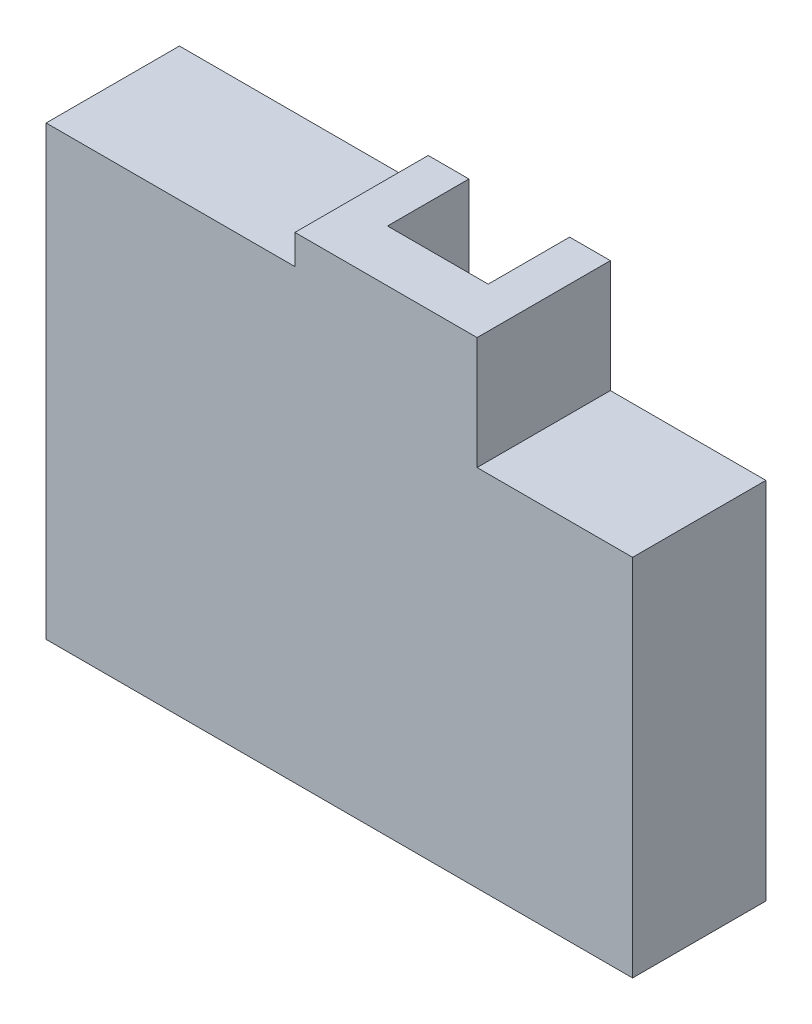
ISO-10303-21;
HEADER;
FILE_DESCRIPTION(('STEP AP214'),'2;1');
FILE_NAME('part.step','',(''),(''),'','','');
FILE_SCHEMA(('AUTOMOTIVE_DESIGN { 1 0 10303 214 1 1 1 1 }'));
ENDSEC;
DATA;
#1=APPLICATION_CONTEXT('core data for automotive mechanical design processes');
#2=APPLICATION_PROTOCOL_DEFINITION('international standard','automotive_design',2000,#1);
#3=PRODUCT_CONTEXT('',#1,'mechanical');
#4=PRODUCT('Part','Part','',(#3));
#5=PRODUCT_RELATED_PRODUCT_CATEGORY('part','',(#4));
#6=PRODUCT_DEFINITION_FORMATION('','',#4);
#7=PRODUCT_DEFINITION_CONTEXT('part definition',#1,'design');
#8=PRODUCT_DEFINITION('design','',#6,#7);
#9=PRODUCT_DEFINITION_SHAPE('','',#8);
#10=(LENGTH_UNIT() NAMED_UNIT(*) SI_UNIT(.MILLI.,.METRE.));
#11=(NAMED_UNIT(*) PLANE_ANGLE_UNIT() SI_UNIT($,.RADIAN.));
#12=(NAMED_UNIT(*) SI_UNIT($,.STERADIAN.) SOLID_ANGLE_UNIT());
#13=UNCERTAINTY_MEASURE_WITH_UNIT(LENGTH_MEASURE(1.E-05),#10,'distance_accuracy_value','');
#14=(GEOMETRIC_REPRESENTATION_CONTEXT(3) GLOBAL_UNCERTAINTY_ASSIGNED_CONTEXT((#13)) GLOBAL_UNIT_ASSIGNED_CONTEXT((#10,
#11,#12)) REPRESENTATION_CONTEXT('',''));
#15=CARTESIAN_POINT('',(0.,0.,0.));
#16=DIRECTION('',(0.,0.,1.));
#17=DIRECTION('',(1.,0.,0.));
#18=AXIS2_PLACEMENT_3D('',#15,#16,#17);
#19=CARTESIAN_POINT('',(0.,0.,-15.));
#20=DIRECTION('',(0.,0.,1.));
#21=DIRECTION('',(1.,0.,0.));
#22=AXIS2_PLACEMENT_3D('',#19,#20,#21);
#23=PLANE('',#22);
#24=DIRECTION('',(1.,0.,0.));
#25=VECTOR('',#24,1.);
#26=CARTESIAN_POINT('',(0.,0.,-15.));
#27=LINE('',#26,#25);
#28=CARTESIAN_POINT('',(51.6,0.,-15.));
#29=VERTEX_POINT('',#28);
#30=CARTESIAN_POINT('',(79.2,0.,-15.));
#31=VERTEX_POINT('',#30);
#32=EDGE_CURVE('E386',#29,#31,#27,.T.);
#33=ORIENTED_EDGE('',*,*,#32,.F.);
#34=DIRECTION('',(0.,-1.,0.));
#35=VECTOR('',#34,1.);
#36=CARTESIAN_POINT('',(51.6,3.,-15.));
#37=LINE('',#36,#35);
#38=CARTESIAN_POINT('',(51.6,3.,-15.));
#39=VERTEX_POINT('',#38);
#40=EDGE_CURVE('E222',#39,#29,#37,.T.);
#41=ORIENTED_EDGE('',*,*,#40,.F.);
#42=DIRECTION('',(1.,0.,0.));
#43=VECTOR('',#42,1.);
#44=CARTESIAN_POINT('',(0.,3.,-15.));
#45=LINE('',#44,#43);
#46=CARTESIAN_POINT('',(76.2,3.,-15.));
#47=VERTEX_POINT('',#46);
#48=EDGE_CURVE('E230',#39,#47,#45,.T.);
#49=ORIENTED_EDGE('',*,*,#48,.T.);
#50=DIRECTION('',(0.,1.,0.));
#51=VECTOR('',#50,1.);
#52=CARTESIAN_POINT('',(76.2,0.,-15.));
#53=LINE('',#52,#51);
#54=CARTESIAN_POINT('',(76.2,46.2,-15.));
#55=VERTEX_POINT('',#54);
#56=EDGE_CURVE('E404',#47,#55,#53,.T.);
#57=ORIENTED_EDGE('',*,*,#56,.T.);
#58=DIRECTION('',(-1.,0.,0.));
#59=VECTOR('',#58,1.);
#60=CARTESIAN_POINT('',(0.,46.2,-15.));
#61=LINE('',#60,#59);
#62=CARTESIAN_POINT('',(58.2,46.2,-15.));
#63=VERTEX_POINT('',#62);
#64=EDGE_CURVE('E401',#55,#63,#61,.T.);
#65=ORIENTED_EDGE('',*,*,#64,.T.);
#66=DIRECTION('',(0.,1.,0.));
#67=VECTOR('',#66,1.);
#68=CARTESIAN_POINT('',(58.2,0.,-15.));
#69=LINE('',#68,#67);
#70=CARTESIAN_POINT('',(58.2,29.,-15.));
#71=VERTEX_POINT('',#70);
#72=EDGE_CURVE('E397',#71,#63,#69,.T.);
#73=ORIENTED_EDGE('',*,*,#72,.F.);
#74=DIRECTION('',(-1.,0.,0.));
#75=VECTOR('',#74,1.);
#76=CARTESIAN_POINT('',(0.,29.,-15.));
#77=LINE('',#76,#75);
#78=CARTESIAN_POINT('',(52.7,29.,-15.));
#79=VERTEX_POINT('',#78);
#80=EDGE_CURVE('E394',#71,#79,#77,.T.);
#81=ORIENTED_EDGE('',*,*,#80,.T.);
#82=DIRECTION('',(0.,-1.,0.));
#83=VECTOR('',#82,1.);
#84=CARTESIAN_POINT('',(52.7,0.,-15.));
#85=LINE('',#84,#83);
#86=CARTESIAN_POINT('',(52.7,64.4,-15.));
#87=VERTEX_POINT('',#86);
#88=EDGE_CURVE('E60',#87,#79,#85,.T.);
#89=ORIENTED_EDGE('',*,*,#88,.F.);
#90=DIRECTION('',(-1.,0.,0.));
#91=VECTOR('',#90,1.);
#92=CARTESIAN_POINT('',(0.,64.4,-15.));
#93=LINE('',#92,#91);
#94=CARTESIAN_POINT('',(58.2,64.4,-15.));
#95=VERTEX_POINT('',#94);
#96=EDGE_CURVE('E352',#95,#87,#93,.T.);
#97=ORIENTED_EDGE('',*,*,#96,.F.);
#98=DIRECTION('',(0.,1.,0.));
#99=VECTOR('',#98,1.);
#100=CARTESIAN_POINT('',(58.2,0.,-15.));
#101=LINE('',#100,#99);
#102=CARTESIAN_POINT('',(58.2,49.2,-15.));
#103=VERTEX_POINT('',#102);
#104=EDGE_CURVE('E359',#103,#95,#101,.T.);
#105=ORIENTED_EDGE('',*,*,#104,.F.);
#106=DIRECTION('',(-1.,0.,0.));
#107=VECTOR('',#106,1.);
#108=CARTESIAN_POINT('',(0.,49.2,-15.));
#109=LINE('',#108,#107);
#110=CARTESIAN_POINT('',(79.2,49.2,-15.));
#111=VERTEX_POINT('',#110);
#112=EDGE_CURVE('E368',#111,#103,#109,.T.);
#113=ORIENTED_EDGE('',*,*,#112,.F.);
#114=DIRECTION('',(0.,1.,0.));
#115=VECTOR('',#114,1.);
#116=CARTESIAN_POINT('',(79.2,0.,-15.));
#117=LINE('',#116,#115);
#118=EDGE_CURVE('E254',#31,#111,#117,.T.);
#119=ORIENTED_EDGE('',*,*,#118,.F.);
#120=EDGE_LOOP('',(#33,#41,#49,#57,#65,#73,#81,#89,#97,#105,#113,#119));
#121=FACE_BOUND('',#120,.T.);
#122=ADVANCED_FACE('F44',(#121),#23,.F.);
#123=CARTESIAN_POINT('',(0.,0.,3.));
#124=DIRECTION('',(-1.,0.,0.));
#125=DIRECTION('',(0.,0.,1.));
#126=AXIS2_PLACEMENT_3D('',#123,#124,#125);
#127=PLANE('',#126);
#128=DIRECTION('',(0.,0.707106781186544,-0.707106781186551));
#129=VECTOR('',#128,1.);
#130=CARTESIAN_POINT('',(0.,3.,0.));
#131=LINE('',#130,#129);
#132=CARTESIAN_POINT('',(0.,3.,0.));
#133=VERTEX_POINT('',#132);
#134=CARTESIAN_POINT('',(0.,17.9999999999998,-15.));
#135=VERTEX_POINT('',#134);
#136=EDGE_CURVE('E534',#133,#135,#131,.T.);
#137=ORIENTED_EDGE('',*,*,#136,.F.);
#138=DIRECTION('',(0.,-1.,0.));
#139=VECTOR('',#138,1.);
#140=CARTESIAN_POINT('',(0.,3.,0.));
#141=LINE('',#140,#139);
#142=CARTESIAN_POINT('',(0.,0.,0.));
#143=VERTEX_POINT('',#142);
#144=EDGE_CURVE('E427',#133,#143,#141,.T.);
#145=ORIENTED_EDGE('',*,*,#144,.T.);
#146=DIRECTION('',(0.,0.,-1.));
#147=VECTOR('',#146,1.);
#148=CARTESIAN_POINT('',(0.,0.,3.));
#149=LINE('',#148,#147);
#150=CARTESIAN_POINT('',(0.,0.,3.));
#151=VERTEX_POINT('',#150);
#152=EDGE_CURVE('E330',#151,#143,#149,.T.);
#153=ORIENTED_EDGE('',*,*,#152,.F.);
#154=DIRECTION('',(0.,1.,0.));
#155=VECTOR('',#154,1.);
#156=CARTESIAN_POINT('',(0.,0.,3.));
#157=LINE('',#156,#155);
#158=CARTESIAN_POINT('',(0.,60.4,3.));
#159=VERTEX_POINT('',#158);
#160=EDGE_CURVE('E313',#151,#159,#157,.T.);
#161=ORIENTED_EDGE('',*,*,#160,.T.);
#162=DIRECTION('',(0.,0.,-1.));
#163=VECTOR('',#162,1.);
#164=CARTESIAN_POINT('',(0.,60.4,3.));
#165=LINE('',#164,#163);
#166=CARTESIAN_POINT('',(0.,60.4,-15.));
#167=VERTEX_POINT('',#166);
#168=EDGE_CURVE('E334',#159,#167,#165,.T.);
#169=ORIENTED_EDGE('',*,*,#168,.T.);
#170=DIRECTION('',(0.,1.,0.));
#171=VECTOR('',#170,1.);
#172=CARTESIAN_POINT('',(0.,0.,-15.));
#173=LINE('',#172,#171);
#174=EDGE_CURVE('E383',#135,#167,#173,.T.);
#175=ORIENTED_EDGE('',*,*,#174,.F.);
#176=EDGE_LOOP('',(#137,#145,#153,#161,#169,#175));
#177=FACE_BOUND('',#176,.T.);
#178=ADVANCED_FACE('F466',(#177),#127,.T.);
#179=CARTESIAN_POINT('',(0.,0.,3.));
#180=DIRECTION('',(0.,1.,0.));
#181=DIRECTION('',(0.,0.,1.));
#182=AXIS2_PLACEMENT_3D('',#179,#180,#181);
#183=PLANE('',#182);
#184=DIRECTION('',(1.,0.,0.));
#185=VECTOR('',#184,1.);
#186=CARTESIAN_POINT('',(0.,0.,0.));
#187=LINE('',#186,#185);
#188=CARTESIAN_POINT('',(36.5999999999996,0.,0.));
#189=VERTEX_POINT('',#188);
#190=EDGE_CURVE('E523',#143,#189,#187,.T.);
#191=ORIENTED_EDGE('',*,*,#190,.T.);
#192=DIRECTION('',(-0.707106781186556,0.,0.707106781186539));
#193=VECTOR('',#192,1.);
#194=CARTESIAN_POINT('',(18.2999999999994,0.,18.2999999999998));
#195=LINE('',#194,#193);
#196=EDGE_CURVE('E219',#29,#189,#195,.T.);
#197=ORIENTED_EDGE('',*,*,#196,.F.);
#198=ORIENTED_EDGE('',*,*,#32,.T.);
#199=DIRECTION('',(0.,0.,-1.));
#200=VECTOR('',#199,1.);
#201=CARTESIAN_POINT('',(79.2,0.,3.));
#202=LINE('',#201,#200);
#203=CARTESIAN_POINT('',(79.2,0.,3.));
#204=VERTEX_POINT('',#203);
#205=EDGE_CURVE('E326',#204,#31,#202,.T.);
#206=ORIENTED_EDGE('',*,*,#205,.F.);
#207=DIRECTION('',(1.,0.,0.));
#208=VECTOR('',#207,1.);
#209=CARTESIAN_POINT('',(0.,0.,3.));
#210=LINE('',#209,#208);
#211=EDGE_CURVE('E317',#151,#204,#210,.T.);
#212=ORIENTED_EDGE('',*,*,#211,.F.);
#213=ORIENTED_EDGE('',*,*,#152,.T.);
#214=EDGE_LOOP('',(#191,#197,#198,#206,#212,#213));
#215=FACE_BOUND('',#214,.T.);
#216=ADVANCED_FACE('F474',(#215),#183,.F.);
#217=CARTESIAN_POINT('',(0.,49.2,3.));
#218=DIRECTION('',(0.,-1.,0.));
#219=DIRECTION('',(0.,0.,-1.));
#220=AXIS2_PLACEMENT_3D('',#217,#218,#219);
#221=PLANE('',#220);
#222=DIRECTION('',(0.,0.,-1.));
#223=VECTOR('',#222,1.);
#224=CARTESIAN_POINT('',(79.2,49.2,3.));
#225=LINE('',#224,#223);
#226=CARTESIAN_POINT('',(79.2,49.2,3.));
#227=VERTEX_POINT('',#226);
#228=EDGE_CURVE('E323',#227,#111,#225,.T.);
#229=ORIENTED_EDGE('',*,*,#228,.T.);
#230=ORIENTED_EDGE('',*,*,#112,.T.);
#231=DIRECTION('',(0.,0.,-1.));
#232=VECTOR('',#231,1.);
#233=CARTESIAN_POINT('',(58.2,49.2,3.));
#234=LINE('',#233,#232);
#235=CARTESIAN_POINT('',(58.2,49.2,3.));
#236=VERTEX_POINT('',#235);
#237=EDGE_CURVE('E11',#236,#103,#234,.T.);
#238=ORIENTED_EDGE('',*,*,#237,.F.);
#239=DIRECTION('',(-1.,0.,0.));
#240=VECTOR('',#239,1.);
#241=CARTESIAN_POINT('',(0.,49.2,3.));
#242=LINE('',#241,#240);
#243=EDGE_CURVE('E258',#227,#236,#242,.T.);
#244=ORIENTED_EDGE('',*,*,#243,.F.);
#245=EDGE_LOOP('',(#229,#230,#238,#244));
#246=FACE_BOUND('',#245,.T.);
#247=ADVANCED_FACE('F46',(#246),#221,.F.);
#248=CARTESIAN_POINT('',(58.2,0.,3.));
#249=DIRECTION('',(-1.,0.,0.));
#250=DIRECTION('',(0.,0.,1.));
#251=AXIS2_PLACEMENT_3D('',#248,#249,#250);
#252=PLANE('',#251);
#253=ORIENTED_EDGE('',*,*,#237,.T.);
#254=ORIENTED_EDGE('',*,*,#104,.T.);
#255=DIRECTION('',(0.,0.,-1.));
#256=VECTOR('',#255,1.);
#257=CARTESIAN_POINT('',(58.2,64.4,3.));
#258=LINE('',#257,#256);
#259=CARTESIAN_POINT('',(58.2,64.4,3.));
#260=VERTEX_POINT('',#259);
#261=EDGE_CURVE('E53',#260,#95,#258,.T.);
#262=ORIENTED_EDGE('',*,*,#261,.F.);
#263=DIRECTION('',(0.,1.,0.));
#264=VECTOR('',#263,1.);
#265=CARTESIAN_POINT('',(58.2,0.,3.));
#266=LINE('',#265,#264);
#267=EDGE_CURVE('E300',#236,#260,#266,.T.);
#268=ORIENTED_EDGE('',*,*,#267,.F.);
#269=EDGE_LOOP('',(#253,#254,#262,#268));
#270=FACE_BOUND('',#269,.T.);
#271=ADVANCED_FACE('F365',(#270),#252,.F.);
#272=CARTESIAN_POINT('',(0.,64.4,3.));
#273=DIRECTION('',(0.,-1.,0.));
#274=DIRECTION('',(0.,0.,-1.));
#275=AXIS2_PLACEMENT_3D('',#272,#273,#274);
#276=PLANE('',#275);
#277=DIRECTION('',(1.,0.,0.));
#278=VECTOR('',#277,1.);
#279=CARTESIAN_POINT('',(0.,64.4,-4.));
#280=LINE('',#279,#278);
#281=CARTESIAN_POINT('',(39.1,64.4,-4.));
#282=VERTEX_POINT('',#281);
#283=CARTESIAN_POINT('',(52.7,64.4,-4.));
#284=VERTEX_POINT('',#283);
#285=EDGE_CURVE('E550',#282,#284,#280,.T.);
#286=ORIENTED_EDGE('',*,*,#285,.F.);
#287=DIRECTION('',(0.,0.,1.));
#288=VECTOR('',#287,1.);
#289=CARTESIAN_POINT('',(39.1,64.4,0.));
#290=LINE('',#289,#288);
#291=CARTESIAN_POINT('',(39.1,64.4,-15.));
#292=VERTEX_POINT('',#291);
#293=EDGE_CURVE('E500',#292,#282,#290,.T.);
#294=ORIENTED_EDGE('',*,*,#293,.F.);
#295=CARTESIAN_POINT('',(33.6,64.4,-15.));
#296=VERTEX_POINT('',#295);
#297=EDGE_CURVE('E363',#292,#296,#93,.T.);
#298=ORIENTED_EDGE('',*,*,#297,.T.);
#299=DIRECTION('',(0.,0.,-1.));
#300=VECTOR('',#299,1.);
#301=CARTESIAN_POINT('',(33.6,64.4,3.));
#302=LINE('',#301,#300);
#303=CARTESIAN_POINT('',(33.6,64.4,3.));
#304=VERTEX_POINT('',#303);
#305=EDGE_CURVE('E341',#304,#296,#302,.T.);
#306=ORIENTED_EDGE('',*,*,#305,.F.);
#307=DIRECTION('',(-1.,0.,0.));
#308=VECTOR('',#307,1.);
#309=CARTESIAN_POINT('',(0.,64.4,3.));
#310=LINE('',#309,#308);
#311=EDGE_CURVE('E303',#260,#304,#310,.T.);
#312=ORIENTED_EDGE('',*,*,#311,.F.);
#313=ORIENTED_EDGE('',*,*,#261,.T.);
#314=ORIENTED_EDGE('',*,*,#96,.T.);
#315=DIRECTION('',(0.,0.,1.));
#316=VECTOR('',#315,1.);
#317=CARTESIAN_POINT('',(52.7,64.4,0.));
#318=LINE('',#317,#316);
#319=EDGE_CURVE('E547',#87,#284,#318,.T.);
#320=ORIENTED_EDGE('',*,*,#319,.T.);
#321=EDGE_LOOP('',(#286,#294,#298,#306,#312,#313,#314,#320));
#322=FACE_BOUND('',#321,.T.);
#323=ADVANCED_FACE('F350',(#322),#276,.F.);
#324=CARTESIAN_POINT('',(33.6,0.,3.));
#325=DIRECTION('',(1.,0.,0.));
#326=DIRECTION('',(0.,0.,-1.));
#327=AXIS2_PLACEMENT_3D('',#324,#325,#326);
#328=PLANE('',#327);
#329=ORIENTED_EDGE('',*,*,#305,.T.);
#330=DIRECTION('',(0.,-1.,0.));
#331=VECTOR('',#330,1.);
#332=CARTESIAN_POINT('',(33.6,0.,-15.));
#333=LINE('',#332,#331);
#334=CARTESIAN_POINT('',(33.6,60.4,-15.));
#335=VERTEX_POINT('',#334);
#336=EDGE_CURVE('E362',#296,#335,#333,.T.);
#337=ORIENTED_EDGE('',*,*,#336,.T.);
#338=DIRECTION('',(0.,0.,-1.));
#339=VECTOR('',#338,1.);
#340=CARTESIAN_POINT('',(33.6,60.4,3.));
#341=LINE('',#340,#339);
#342=CARTESIAN_POINT('',(33.6,60.4,3.));
#343=VERTEX_POINT('',#342);
#344=EDGE_CURVE('E338',#343,#335,#341,.T.);
#345=ORIENTED_EDGE('',*,*,#344,.F.);
#346=DIRECTION('',(0.,-1.,0.));
#347=VECTOR('',#346,1.);
#348=CARTESIAN_POINT('',(33.6,0.,3.));
#349=LINE('',#348,#347);
#350=EDGE_CURVE('E306',#304,#343,#349,.T.);
#351=ORIENTED_EDGE('',*,*,#350,.F.);
#352=EDGE_LOOP('',(#329,#337,#345,#351));
#353=FACE_BOUND('',#352,.T.);
#354=ADVANCED_FACE('F502',(#353),#328,.F.);
#355=CARTESIAN_POINT('',(0.,60.4,3.));
#356=DIRECTION('',(0.,1.,0.));
#357=DIRECTION('',(0.,0.,1.));
#358=AXIS2_PLACEMENT_3D('',#355,#356,#357);
#359=PLANE('',#358);
#360=ORIENTED_EDGE('',*,*,#344,.T.);
#361=DIRECTION('',(-1.,0.,0.));
#362=VECTOR('',#361,1.);
#363=CARTESIAN_POINT('',(0.,60.4,-15.));
#364=LINE('',#363,#362);
#365=EDGE_CURVE('E378',#335,#167,#364,.T.);
#366=ORIENTED_EDGE('',*,*,#365,.T.);
#367=ORIENTED_EDGE('',*,*,#168,.F.);
#368=DIRECTION('',(1.,0.,0.));
#369=VECTOR('',#368,1.);
#370=CARTESIAN_POINT('',(0.,60.4,3.));
#371=LINE('',#370,#369);
#372=EDGE_CURVE('E309',#159,#343,#371,.T.);
#373=ORIENTED_EDGE('',*,*,#372,.T.);
#374=EDGE_LOOP('',(#360,#366,#367,#373));
#375=FACE_BOUND('',#374,.T.);
#376=ADVANCED_FACE('F607',(#375),#359,.T.);
#377=CARTESIAN_POINT('',(79.2,0.,3.));
#378=DIRECTION('',(-1.,0.,0.));
#379=DIRECTION('',(0.,0.,1.));
#380=AXIS2_PLACEMENT_3D('',#377,#378,#379);
#381=PLANE('',#380);
#382=ORIENTED_EDGE('',*,*,#205,.T.);
#383=ORIENTED_EDGE('',*,*,#118,.T.);
#384=ORIENTED_EDGE('',*,*,#228,.F.);
#385=DIRECTION('',(0.,1.,0.));
#386=VECTOR('',#385,1.);
#387=CARTESIAN_POINT('',(79.2,0.,3.));
#388=LINE('',#387,#386);
#389=EDGE_CURVE('E320',#204,#227,#388,.T.);
#390=ORIENTED_EDGE('',*,*,#389,.F.);
#391=EDGE_LOOP('',(#382,#383,#384,#390));
#392=FACE_BOUND('',#391,.T.);
#393=ADVANCED_FACE('F515',(#392),#381,.F.);
#394=CARTESIAN_POINT('',(0.,0.,3.));
#395=DIRECTION('',(0.,0.,1.));
#396=DIRECTION('',(1.,0.,0.));
#397=AXIS2_PLACEMENT_3D('',#394,#395,#396);
#398=PLANE('',#397);
#399=ORIENTED_EDGE('',*,*,#243,.T.);
#400=ORIENTED_EDGE('',*,*,#267,.T.);
#401=ORIENTED_EDGE('',*,*,#311,.T.);
#402=ORIENTED_EDGE('',*,*,#350,.T.);
#403=ORIENTED_EDGE('',*,*,#372,.F.);
#404=ORIENTED_EDGE('',*,*,#160,.F.);
#405=ORIENTED_EDGE('',*,*,#211,.T.);
#406=ORIENTED_EDGE('',*,*,#389,.T.);
#407=EDGE_LOOP('',(#399,#400,#401,#402,#403,#404,#405,#406));
#408=FACE_BOUND('',#407,.T.);
#409=ADVANCED_FACE('F506',(#408),#398,.T.);
#410=CARTESIAN_POINT('',(39.1,0.,-15.));
#411=DIRECTION('',(1.,0.,0.));
#412=DIRECTION('',(0.,0.,-1.));
#413=AXIS2_PLACEMENT_3D('',#410,#411,#412);
#414=PLANE('',#413);
#415=DIRECTION('',(0.,1.,0.));
#416=VECTOR('',#415,1.);
#417=CARTESIAN_POINT('',(39.1,0.,0.));
#418=LINE('',#417,#416);
#419=CARTESIAN_POINT('',(39.1,29.,0.));
#420=VERTEX_POINT('',#419);
#421=CARTESIAN_POINT('',(39.1,61.4,0.));
#422=VERTEX_POINT('',#421);
#423=EDGE_CURVE('E423',#420,#422,#418,.T.);
#424=ORIENTED_EDGE('',*,*,#423,.F.);
#425=DIRECTION('',(0.,0.,1.));
#426=VECTOR('',#425,1.);
#427=CARTESIAN_POINT('',(39.1,29.,-15.));
#428=LINE('',#427,#426);
#429=CARTESIAN_POINT('',(39.1,29.,-15.));
#430=VERTEX_POINT('',#429);
#431=EDGE_CURVE('E255',#430,#420,#428,.T.);
#432=ORIENTED_EDGE('',*,*,#431,.F.);
#433=DIRECTION('',(0.,1.,0.));
#434=VECTOR('',#433,1.);
#435=CARTESIAN_POINT('',(39.1,0.,-15.));
#436=LINE('',#435,#434);
#437=EDGE_CURVE('E389',#430,#292,#436,.T.);
#438=ORIENTED_EDGE('',*,*,#437,.T.);
#439=ORIENTED_EDGE('',*,*,#293,.T.);
#440=DIRECTION('',(0.,1.,0.));
#441=VECTOR('',#440,1.);
#442=CARTESIAN_POINT('',(39.1,61.4,-4.));
#443=LINE('',#442,#441);
#444=CARTESIAN_POINT('',(39.1,61.4,-4.));
#445=VERTEX_POINT('',#444);
#446=EDGE_CURVE('E541',#445,#282,#443,.T.);
#447=ORIENTED_EDGE('',*,*,#446,.F.);
#448=DIRECTION('',(0.,0.,1.));
#449=VECTOR('',#448,1.);
#450=CARTESIAN_POINT('',(39.1,61.4,-15.));
#451=LINE('',#450,#449);
#452=EDGE_CURVE('E293',#445,#422,#451,.T.);
#453=ORIENTED_EDGE('',*,*,#452,.T.);
#454=EDGE_LOOP('',(#424,#432,#438,#439,#447,#453));
#455=FACE_BOUND('',#454,.T.);
#456=ADVANCED_FACE('F583',(#455),#414,.T.);
#457=CARTESIAN_POINT('',(0.,29.,-15.));
#458=DIRECTION('',(0.,-1.,0.));
#459=DIRECTION('',(0.,0.,-1.));
#460=AXIS2_PLACEMENT_3D('',#457,#458,#459);
#461=PLANE('',#460);
#462=DIRECTION('',(1.,0.,0.));
#463=VECTOR('',#462,1.);
#464=CARTESIAN_POINT('',(0.,29.,0.));
#465=LINE('',#464,#463);
#466=CARTESIAN_POINT('',(33.6,29.,0.));
#467=VERTEX_POINT('',#466);
#468=EDGE_CURVE('E68',#467,#420,#465,.T.);
#469=ORIENTED_EDGE('',*,*,#468,.F.);
#470=DIRECTION('',(0.,0.,1.));
#471=VECTOR('',#470,1.);
#472=CARTESIAN_POINT('',(33.6,29.,-15.));
#473=LINE('',#472,#471);
#474=CARTESIAN_POINT('',(33.6,29.,-15.));
#475=VERTEX_POINT('',#474);
#476=EDGE_CURVE('E259',#475,#467,#473,.T.);
#477=ORIENTED_EDGE('',*,*,#476,.F.);
#478=DIRECTION('',(1.,0.,0.));
#479=VECTOR('',#478,1.);
#480=CARTESIAN_POINT('',(0.,29.,-15.));
#481=LINE('',#480,#479);
#482=EDGE_CURVE('E296',#475,#430,#481,.T.);
#483=ORIENTED_EDGE('',*,*,#482,.T.);
#484=ORIENTED_EDGE('',*,*,#431,.T.);
#485=EDGE_LOOP('',(#469,#477,#483,#484));
#486=FACE_BOUND('',#485,.T.);
#487=ADVANCED_FACE('F580',(#486),#461,.T.);
#488=CARTESIAN_POINT('',(33.6,0.,-15.));
#489=DIRECTION('',(-1.,0.,0.));
#490=DIRECTION('',(0.,0.,1.));
#491=AXIS2_PLACEMENT_3D('',#488,#489,#490);
#492=PLANE('',#491);
#493=DIRECTION('',(0.,-1.,0.));
#494=VECTOR('',#493,1.);
#495=CARTESIAN_POINT('',(33.6,0.,0.));
#496=LINE('',#495,#494);
#497=CARTESIAN_POINT('',(33.6,57.4,0.));
#498=VERTEX_POINT('',#497);
#499=EDGE_CURVE('E251',#498,#467,#496,.T.);
#500=ORIENTED_EDGE('',*,*,#499,.F.);
#501=DIRECTION('',(0.,0.,1.));
#502=VECTOR('',#501,1.);
#503=CARTESIAN_POINT('',(33.6,57.4,-15.));
#504=LINE('',#503,#502);
#505=CARTESIAN_POINT('',(33.6,57.4,-15.));
#506=VERTEX_POINT('',#505);
#507=EDGE_CURVE('E263',#506,#498,#504,.T.);
#508=ORIENTED_EDGE('',*,*,#507,.F.);
#509=EDGE_CURVE('E379',#506,#475,#333,.T.);
#510=ORIENTED_EDGE('',*,*,#509,.T.);
#511=ORIENTED_EDGE('',*,*,#476,.T.);
#512=EDGE_LOOP('',(#500,#508,#510,#511));
#513=FACE_BOUND('',#512,.T.);
#514=ADVANCED_FACE('F578',(#513),#492,.T.);
#515=CARTESIAN_POINT('',(0.,57.4,-15.));
#516=DIRECTION('',(0.,-1.,0.));
#517=DIRECTION('',(0.,0.,-1.));
#518=AXIS2_PLACEMENT_3D('',#515,#516,#517);
#519=PLANE('',#518);
#520=DIRECTION('',(1.,0.,0.));
#521=VECTOR('',#520,1.);
#522=CARTESIAN_POINT('',(0.,57.4,0.));
#523=LINE('',#522,#521);
#524=CARTESIAN_POINT('',(3.,57.4,0.));
#525=VERTEX_POINT('',#524);
#526=EDGE_CURVE('E243',#525,#498,#523,.T.);
#527=ORIENTED_EDGE('',*,*,#526,.F.);
#528=DIRECTION('',(0.,0.,1.));
#529=VECTOR('',#528,1.);
#530=CARTESIAN_POINT('',(3.,57.4,-15.));
#531=LINE('',#530,#529);
#532=CARTESIAN_POINT('',(3.,57.4,-15.));
#533=VERTEX_POINT('',#532);
#534=EDGE_CURVE('E267',#533,#525,#531,.T.);
#535=ORIENTED_EDGE('',*,*,#534,.F.);
#536=DIRECTION('',(1.,0.,0.));
#537=VECTOR('',#536,1.);
#538=CARTESIAN_POINT('',(0.,57.4,-15.));
#539=LINE('',#538,#537);
#540=EDGE_CURVE('E414',#533,#506,#539,.T.);
#541=ORIENTED_EDGE('',*,*,#540,.T.);
#542=ORIENTED_EDGE('',*,*,#507,.T.);
#543=EDGE_LOOP('',(#527,#535,#541,#542));
#544=FACE_BOUND('',#543,.T.);
#545=ADVANCED_FACE('F575',(#544),#519,.T.);
#546=CARTESIAN_POINT('',(3.,0.,-15.));
#547=DIRECTION('',(-1.,0.,0.));
#548=DIRECTION('',(0.,-1.,0.));
#549=AXIS2_PLACEMENT_3D('',#546,#547,#548);
#550=PLANE('',#549);
#551=DIRECTION('',(0.,-1.,0.));
#552=VECTOR('',#551,1.);
#553=CARTESIAN_POINT('',(3.,0.,0.));
#554=LINE('',#553,#552);
#555=CARTESIAN_POINT('',(3.,3.,0.));
#556=VERTEX_POINT('',#555);
#557=EDGE_CURVE('E238',#525,#556,#554,.T.);
#558=ORIENTED_EDGE('',*,*,#557,.T.);
#559=DIRECTION('',(0.,0.707106781186544,-0.707106781186551));
#560=VECTOR('',#559,1.);
#561=CARTESIAN_POINT('',(3.,3.,0.));
#562=LINE('',#561,#560);
#563=CARTESIAN_POINT('',(3.,17.9999999999998,-15.));
#564=VERTEX_POINT('',#563);
#565=EDGE_CURVE('E533',#556,#564,#562,.T.);
#566=ORIENTED_EDGE('',*,*,#565,.T.);
#567=DIRECTION('',(0.,-1.,0.));
#568=VECTOR('',#567,1.);
#569=CARTESIAN_POINT('',(3.,0.,-15.));
#570=LINE('',#569,#568);
#571=EDGE_CURVE('E410',#533,#564,#570,.T.);
#572=ORIENTED_EDGE('',*,*,#571,.F.);
#573=ORIENTED_EDGE('',*,*,#534,.T.);
#574=EDGE_LOOP('',(#558,#566,#572,#573));
#575=FACE_BOUND('',#574,.T.);
#576=ADVANCED_FACE('F463',(#575),#550,.F.);
#577=CARTESIAN_POINT('',(0.,3.,-15.));
#578=DIRECTION('',(0.,-1.,0.));
#579=DIRECTION('',(0.,0.,-1.));
#580=AXIS2_PLACEMENT_3D('',#577,#578,#579);
#581=PLANE('',#580);
#582=ORIENTED_EDGE('',*,*,#48,.F.);
#583=DIRECTION('',(-0.707106781186556,0.,0.707106781186539));
#584=VECTOR('',#583,1.);
#585=CARTESIAN_POINT('',(18.2999999999994,3.,18.2999999999998));
#586=LINE('',#585,#584);
#587=CARTESIAN_POINT('',(36.5999999999996,3.,0.));
#588=VERTEX_POINT('',#587);
#589=EDGE_CURVE('E216',#39,#588,#586,.T.);
#590=ORIENTED_EDGE('',*,*,#589,.T.);
#591=DIRECTION('',(1.,0.,0.));
#592=VECTOR('',#591,1.);
#593=CARTESIAN_POINT('',(0.,3.,0.));
#594=LINE('',#593,#592);
#595=CARTESIAN_POINT('',(76.2,3.,0.));
#596=VERTEX_POINT('',#595);
#597=EDGE_CURVE('E228',#588,#596,#594,.T.);
#598=ORIENTED_EDGE('',*,*,#597,.T.);
#599=DIRECTION('',(0.,0.,1.));
#600=VECTOR('',#599,1.);
#601=CARTESIAN_POINT('',(76.2,3.,-15.));
#602=LINE('',#601,#600);
#603=EDGE_CURVE('E271',#47,#596,#602,.T.);
#604=ORIENTED_EDGE('',*,*,#603,.F.);
#605=EDGE_LOOP('',(#582,#590,#598,#604));
#606=FACE_BOUND('',#605,.T.);
#607=ADVANCED_FACE('F226',(#606),#581,.F.);
#608=CARTESIAN_POINT('',(76.2,0.,-15.));
#609=DIRECTION('',(1.,0.,0.));
#610=DIRECTION('',(0.,0.,-1.));
#611=AXIS2_PLACEMENT_3D('',#608,#609,#610);
#612=PLANE('',#611);
#613=DIRECTION('',(0.,1.,0.));
#614=VECTOR('',#613,1.);
#615=CARTESIAN_POINT('',(76.2,0.,0.));
#616=LINE('',#615,#614);
#617=CARTESIAN_POINT('',(76.2,46.2,0.));
#618=VERTEX_POINT('',#617);
#619=EDGE_CURVE('E235',#596,#618,#616,.T.);
#620=ORIENTED_EDGE('',*,*,#619,.T.);
#621=DIRECTION('',(0.,0.,1.));
#622=VECTOR('',#621,1.);
#623=CARTESIAN_POINT('',(76.2,46.2,-15.));
#624=LINE('',#623,#622);
#625=EDGE_CURVE('E274',#55,#618,#624,.T.);
#626=ORIENTED_EDGE('',*,*,#625,.F.);
#627=ORIENTED_EDGE('',*,*,#56,.F.);
#628=ORIENTED_EDGE('',*,*,#603,.T.);
#629=EDGE_LOOP('',(#620,#626,#627,#628));
#630=FACE_BOUND('',#629,.T.);
#631=ADVANCED_FACE('F454',(#630),#612,.F.);
#632=CARTESIAN_POINT('',(0.,46.2,-15.));
#633=DIRECTION('',(0.,1.,0.));
#634=DIRECTION('',(0.,0.,1.));
#635=AXIS2_PLACEMENT_3D('',#632,#633,#634);
#636=PLANE('',#635);
#637=DIRECTION('',(-1.,0.,0.));
#638=VECTOR('',#637,1.);
#639=CARTESIAN_POINT('',(0.,46.2,0.));
#640=LINE('',#639,#638);
#641=CARTESIAN_POINT('',(58.2,46.2,0.));
#642=VERTEX_POINT('',#641);
#643=EDGE_CURVE('E245',#618,#642,#640,.T.);
#644=ORIENTED_EDGE('',*,*,#643,.T.);
#645=DIRECTION('',(0.,0.,1.));
#646=VECTOR('',#645,1.);
#647=CARTESIAN_POINT('',(58.2,46.2,-15.));
#648=LINE('',#647,#646);
#649=EDGE_CURVE('E278',#63,#642,#648,.T.);
#650=ORIENTED_EDGE('',*,*,#649,.F.);
#651=ORIENTED_EDGE('',*,*,#64,.F.);
#652=ORIENTED_EDGE('',*,*,#625,.T.);
#653=EDGE_LOOP('',(#644,#650,#651,#652));
#654=FACE_BOUND('',#653,.T.);
#655=ADVANCED_FACE('F444',(#654),#636,.F.);
#656=CARTESIAN_POINT('',(58.2,0.,-15.));
#657=DIRECTION('',(1.,0.,0.));
#658=DIRECTION('',(0.,0.,-1.));
#659=AXIS2_PLACEMENT_3D('',#656,#657,#658);
#660=PLANE('',#659);
#661=DIRECTION('',(0.,1.,0.));
#662=VECTOR('',#661,1.);
#663=CARTESIAN_POINT('',(58.2,0.,0.));
#664=LINE('',#663,#662);
#665=CARTESIAN_POINT('',(58.2,29.,0.));
#666=VERTEX_POINT('',#665);
#667=EDGE_CURVE('E438',#666,#642,#664,.T.);
#668=ORIENTED_EDGE('',*,*,#667,.F.);
#669=DIRECTION('',(0.,0.,1.));
#670=VECTOR('',#669,1.);
#671=CARTESIAN_POINT('',(58.2,29.,-15.));
#672=LINE('',#671,#670);
#673=EDGE_CURVE('E282',#71,#666,#672,.T.);
#674=ORIENTED_EDGE('',*,*,#673,.F.);
#675=ORIENTED_EDGE('',*,*,#72,.T.);
#676=ORIENTED_EDGE('',*,*,#649,.T.);
#677=EDGE_LOOP('',(#668,#674,#675,#676));
#678=FACE_BOUND('',#677,.T.);
#679=ADVANCED_FACE('F448',(#678),#660,.T.);
#680=CARTESIAN_POINT('',(0.,29.,-15.));
#681=DIRECTION('',(0.,1.,0.));
#682=DIRECTION('',(0.,0.,1.));
#683=AXIS2_PLACEMENT_3D('',#680,#681,#682);
#684=PLANE('',#683);
#685=DIRECTION('',(-1.,0.,0.));
#686=VECTOR('',#685,1.);
#687=CARTESIAN_POINT('',(0.,29.,0.));
#688=LINE('',#687,#686);
#689=CARTESIAN_POINT('',(52.7,29.,0.));
#690=VERTEX_POINT('',#689);
#691=EDGE_CURVE('E434',#666,#690,#688,.T.);
#692=ORIENTED_EDGE('',*,*,#691,.T.);
#693=DIRECTION('',(0.,0.,1.));
#694=VECTOR('',#693,1.);
#695=CARTESIAN_POINT('',(52.7,29.,-15.));
#696=LINE('',#695,#694);
#697=EDGE_CURVE('E286',#79,#690,#696,.T.);
#698=ORIENTED_EDGE('',*,*,#697,.F.);
#699=ORIENTED_EDGE('',*,*,#80,.F.);
#700=ORIENTED_EDGE('',*,*,#673,.T.);
#701=EDGE_LOOP('',(#692,#698,#699,#700));
#702=FACE_BOUND('',#701,.T.);
#703=ADVANCED_FACE('F591',(#702),#684,.F.);
#704=CARTESIAN_POINT('',(52.7,0.,-15.));
#705=DIRECTION('',(-1.,0.,0.));
#706=DIRECTION('',(0.,-1.,0.));
#707=AXIS2_PLACEMENT_3D('',#704,#705,#706);
#708=PLANE('',#707);
#709=DIRECTION('',(0.,-1.,0.));
#710=VECTOR('',#709,1.);
#711=CARTESIAN_POINT('',(52.7,0.,0.));
#712=LINE('',#711,#710);
#713=CARTESIAN_POINT('',(52.7,61.4,0.));
#714=VERTEX_POINT('',#713);
#715=EDGE_CURVE('E431',#714,#690,#712,.T.);
#716=ORIENTED_EDGE('',*,*,#715,.F.);
#717=DIRECTION('',(0.,0.,1.));
#718=VECTOR('',#717,1.);
#719=CARTESIAN_POINT('',(52.7,61.4,-15.));
#720=LINE('',#719,#718);
#721=CARTESIAN_POINT('',(52.7,61.4,-4.));
#722=VERTEX_POINT('',#721);
#723=EDGE_CURVE('E290',#722,#714,#720,.T.);
#724=ORIENTED_EDGE('',*,*,#723,.F.);
#725=DIRECTION('',(0.,1.,0.));
#726=VECTOR('',#725,1.);
#727=CARTESIAN_POINT('',(52.7,61.4,-4.));
#728=LINE('',#727,#726);
#729=EDGE_CURVE('E537',#722,#284,#728,.T.);
#730=ORIENTED_EDGE('',*,*,#729,.T.);
#731=ORIENTED_EDGE('',*,*,#319,.F.);
#732=ORIENTED_EDGE('',*,*,#88,.T.);
#733=ORIENTED_EDGE('',*,*,#697,.T.);
#734=EDGE_LOOP('',(#716,#724,#730,#731,#732,#733));
#735=FACE_BOUND('',#734,.T.);
#736=ADVANCED_FACE('F489',(#735),#708,.T.);
#737=CARTESIAN_POINT('',(0.,61.4,-15.));
#738=DIRECTION('',(0.,1.,0.));
#739=DIRECTION('',(0.,0.,1.));
#740=AXIS2_PLACEMENT_3D('',#737,#738,#739);
#741=PLANE('',#740);
#742=ORIENTED_EDGE('',*,*,#452,.F.);
#743=DIRECTION('',(1.,0.,0.));
#744=VECTOR('',#743,1.);
#745=CARTESIAN_POINT('',(0.,61.4,-4.));
#746=LINE('',#745,#744);
#747=EDGE_CURVE('E544',#445,#722,#746,.T.);
#748=ORIENTED_EDGE('',*,*,#747,.T.);
#749=ORIENTED_EDGE('',*,*,#723,.T.);
#750=DIRECTION('',(-1.,0.,0.));
#751=VECTOR('',#750,1.);
#752=CARTESIAN_POINT('',(0.,61.4,0.));
#753=LINE('',#752,#751);
#754=EDGE_CURVE('E426',#714,#422,#753,.T.);
#755=ORIENTED_EDGE('',*,*,#754,.T.);
#756=EDGE_LOOP('',(#742,#748,#749,#755));
#757=FACE_BOUND('',#756,.T.);
#758=ADVANCED_FACE('F480',(#757),#741,.F.);
#759=ORIENTED_EDGE('',*,*,#297,.F.);
#760=ORIENTED_EDGE('',*,*,#437,.F.);
#761=ORIENTED_EDGE('',*,*,#482,.F.);
#762=ORIENTED_EDGE('',*,*,#509,.F.);
#763=ORIENTED_EDGE('',*,*,#540,.F.);
#764=ORIENTED_EDGE('',*,*,#571,.T.);
#765=DIRECTION('',(-1.,0.,0.));
#766=VECTOR('',#765,1.);
#767=CARTESIAN_POINT('',(3.,17.9999999999998,-15.));
#768=LINE('',#767,#766);
#769=EDGE_CURVE('E526',#564,#135,#768,.T.);
#770=ORIENTED_EDGE('',*,*,#769,.T.);
#771=ORIENTED_EDGE('',*,*,#174,.T.);
#772=ORIENTED_EDGE('',*,*,#365,.F.);
#773=ORIENTED_EDGE('',*,*,#336,.F.);
#774=EDGE_LOOP('',(#759,#760,#761,#762,#763,#764,#770,#771,#772,#773));
#775=FACE_BOUND('',#774,.T.);
#776=ADVANCED_FACE('F468',(#775),#23,.F.);
#777=CARTESIAN_POINT('',(0.,0.,0.));
#778=DIRECTION('',(0.,0.,1.));
#779=DIRECTION('',(1.,0.,0.));
#780=AXIS2_PLACEMENT_3D('',#777,#778,#779);
#781=PLANE('',#780);
#782=ORIENTED_EDGE('',*,*,#597,.F.);
#783=DIRECTION('',(0.,-1.,0.));
#784=VECTOR('',#783,1.);
#785=CARTESIAN_POINT('',(36.5999999999996,3.,0.));
#786=LINE('',#785,#784);
#787=EDGE_CURVE('E213',#588,#189,#786,.T.);
#788=ORIENTED_EDGE('',*,*,#787,.T.);
#789=ORIENTED_EDGE('',*,*,#190,.F.);
#790=ORIENTED_EDGE('',*,*,#144,.F.);
#791=DIRECTION('',(1.,0.,0.));
#792=VECTOR('',#791,1.);
#793=CARTESIAN_POINT('',(0.,3.,0.));
#794=LINE('',#793,#792);
#795=EDGE_CURVE('E522',#133,#556,#794,.T.);
#796=ORIENTED_EDGE('',*,*,#795,.T.);
#797=ORIENTED_EDGE('',*,*,#557,.F.);
#798=ORIENTED_EDGE('',*,*,#526,.T.);
#799=ORIENTED_EDGE('',*,*,#499,.T.);
#800=ORIENTED_EDGE('',*,*,#468,.T.);
#801=ORIENTED_EDGE('',*,*,#423,.T.);
#802=ORIENTED_EDGE('',*,*,#754,.F.);
#803=ORIENTED_EDGE('',*,*,#715,.T.);
#804=ORIENTED_EDGE('',*,*,#691,.F.);
#805=ORIENTED_EDGE('',*,*,#667,.T.);
#806=ORIENTED_EDGE('',*,*,#643,.F.);
#807=ORIENTED_EDGE('',*,*,#619,.F.);
#808=EDGE_LOOP('',(#782,#788,#789,#790,#796,#797,#798,#799,#800,#801,#802,#803,#804,#805,#806,#807));
#809=FACE_BOUND('',#808,.T.);
#810=ADVANCED_FACE('F233',(#809),#781,.F.);
#811=CARTESIAN_POINT('',(3.,3.,0.));
#812=DIRECTION('',(0.,0.707106781186551,0.707106781186544));
#813=DIRECTION('',(0.,-0.707106781186544,0.707106781186551));
#814=AXIS2_PLACEMENT_3D('',#811,#812,#813);
#815=PLANE('',#814);
#816=ORIENTED_EDGE('',*,*,#136,.T.);
#817=ORIENTED_EDGE('',*,*,#769,.F.);
#818=ORIENTED_EDGE('',*,*,#565,.F.);
#819=ORIENTED_EDGE('',*,*,#795,.F.);
#820=EDGE_LOOP('',(#816,#817,#818,#819));
#821=FACE_BOUND('',#820,.T.);
#822=ADVANCED_FACE('F487',(#821),#815,.F.);
#823=CARTESIAN_POINT('',(0.,61.4,-4.));
#824=DIRECTION('',(0.,0.,1.));
#825=DIRECTION('',(1.,0.,0.));
#826=AXIS2_PLACEMENT_3D('',#823,#824,#825);
#827=PLANE('',#826);
#828=ORIENTED_EDGE('',*,*,#285,.T.);
#829=ORIENTED_EDGE('',*,*,#729,.F.);
#830=ORIENTED_EDGE('',*,*,#747,.F.);
#831=ORIENTED_EDGE('',*,*,#446,.T.);
#832=EDGE_LOOP('',(#828,#829,#830,#831));
#833=FACE_BOUND('',#832,.T.);
#834=ADVANCED_FACE('F648',(#833),#827,.F.);
#835=CARTESIAN_POINT('',(18.2999999999994,3.,18.2999999999998));
#836=DIRECTION('',(0.707106781186539,0.,0.707106781186556));
#837=DIRECTION('',(0.707106781186556,0.,-0.707106781186539));
#838=AXIS2_PLACEMENT_3D('',#835,#836,#837);
#839=PLANE('',#838);
#840=ORIENTED_EDGE('',*,*,#196,.T.);
#841=ORIENTED_EDGE('',*,*,#787,.F.);
#842=ORIENTED_EDGE('',*,*,#589,.F.);
#843=ORIENTED_EDGE('',*,*,#40,.T.);
#844=EDGE_LOOP('',(#840,#841,#842,#843));
#845=FACE_BOUND('',#844,.T.);
#846=ADVANCED_FACE('F215',(#845),#839,.F.);
#847=CLOSED_SHELL('',(#122,#178,#216,#247,#271,#323,#354,#376,#393,#409,#456,#487,#514,#545,
#576,#607,#631,#655,#679,#703,#736,#758,#776,#810,#822,#834,#846));
#848=MANIFOLD_SOLID_BREP('B2',#847);
#849=ADVANCED_BREP_SHAPE_REPRESENTATION('',(#18,#848),#14);
#850=SHAPE_DEFINITION_REPRESENTATION(#9,#849);
ENDSEC;
END-ISO-10303-21;
